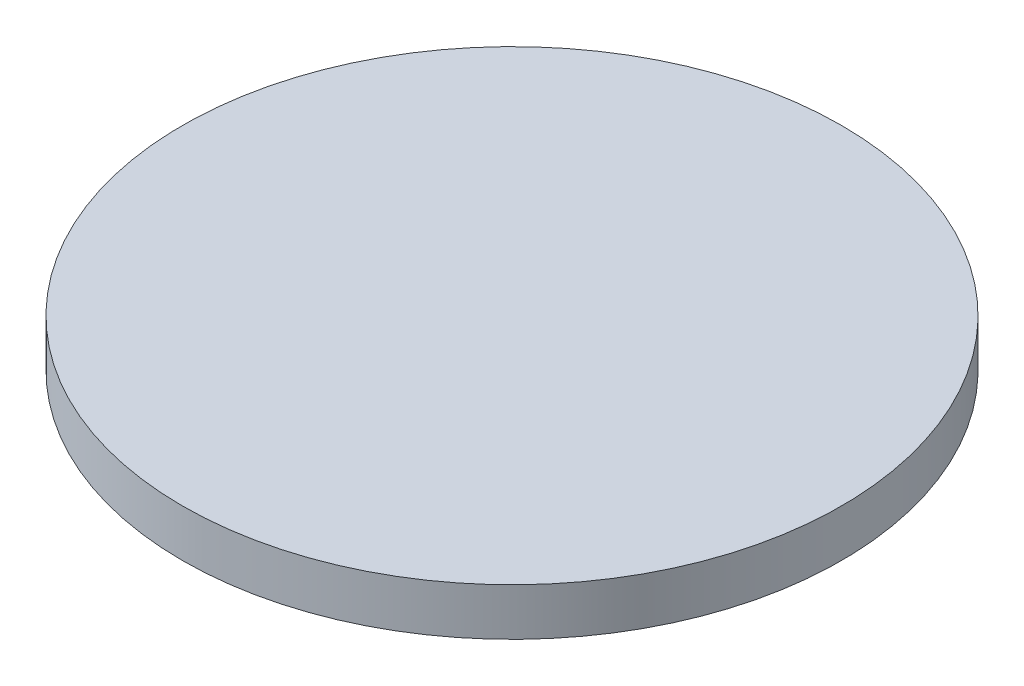
ISO-10303-21;
HEADER;
FILE_DESCRIPTION(('STEP AP214'),'2;1');
FILE_NAME('part.step','',(''),(''),'','','');
FILE_SCHEMA(('AUTOMOTIVE_DESIGN { 1 0 10303 214 1 1 1 1 }'));
ENDSEC;
DATA;
#1=APPLICATION_CONTEXT('core data for automotive mechanical design processes');
#2=APPLICATION_PROTOCOL_DEFINITION('international standard','automotive_design',2000,#1);
#3=PRODUCT_CONTEXT('',#1,'mechanical');
#4=PRODUCT('Part','Part','',(#3));
#5=PRODUCT_RELATED_PRODUCT_CATEGORY('part','',(#4));
#6=PRODUCT_DEFINITION_FORMATION('','',#4);
#7=PRODUCT_DEFINITION_CONTEXT('part definition',#1,'design');
#8=PRODUCT_DEFINITION('design','',#6,#7);
#9=PRODUCT_DEFINITION_SHAPE('','',#8);
#10=(LENGTH_UNIT() NAMED_UNIT(*) SI_UNIT(.MILLI.,.METRE.));
#11=(NAMED_UNIT(*) PLANE_ANGLE_UNIT() SI_UNIT($,.RADIAN.));
#12=(NAMED_UNIT(*) SI_UNIT($,.STERADIAN.) SOLID_ANGLE_UNIT());
#13=UNCERTAINTY_MEASURE_WITH_UNIT(LENGTH_MEASURE(1.E-05),#10,'distance_accuracy_value','');
#14=(GEOMETRIC_REPRESENTATION_CONTEXT(3) GLOBAL_UNCERTAINTY_ASSIGNED_CONTEXT((#13)) GLOBAL_UNIT_ASSIGNED_CONTEXT((#10,
#11,#12)) REPRESENTATION_CONTEXT('',''));
#15=CARTESIAN_POINT('',(0.,0.,0.));
#16=DIRECTION('',(0.,0.,1.));
#17=DIRECTION('',(1.,0.,0.));
#18=AXIS2_PLACEMENT_3D('',#15,#16,#17);
#19=CARTESIAN_POINT('',(0.,1.5,0.));
#20=DIRECTION('',(0.,-1.,0.));
#21=DIRECTION('',(0.,0.,-1.));
#22=AXIS2_PLACEMENT_3D('',#19,#20,#21);
#23=CYLINDRICAL_SURFACE('',#22,10.45);
#24=CARTESIAN_POINT('',(0.,1.5,0.));
#25=DIRECTION('',(0.,1.,0.));
#26=DIRECTION('',(0.,0.,1.));
#27=AXIS2_PLACEMENT_3D('',#24,#25,#26);
#28=CIRCLE('',#27,10.45);
#29=CARTESIAN_POINT('',(0.,1.5,10.45));
#30=VERTEX_POINT('',#29);
#31=EDGE_CURVE('E10',#30,#30,#28,.T.);
#32=ORIENTED_EDGE('',*,*,#31,.F.);
#33=EDGE_LOOP('',(#32));
#34=FACE_BOUND('',#33,.T.);
#35=CARTESIAN_POINT('',(0.,0.,0.));
#36=DIRECTION('',(0.,1.,0.));
#37=DIRECTION('',(0.,0.,1.));
#38=AXIS2_PLACEMENT_3D('',#35,#36,#37);
#39=CIRCLE('',#38,10.45);
#40=CARTESIAN_POINT('',(0.,0.,10.45));
#41=VERTEX_POINT('',#40);
#42=EDGE_CURVE('E40',#41,#41,#39,.T.);
#43=ORIENTED_EDGE('',*,*,#42,.T.);
#44=EDGE_LOOP('',(#43));
#45=FACE_BOUND('',#44,.T.);
#46=ADVANCED_FACE('F37',(#34,#45),#23,.T.);
#47=CARTESIAN_POINT('',(0.,1.5,0.));
#48=DIRECTION('',(0.,1.,0.));
#49=DIRECTION('',(0.,0.,1.));
#50=AXIS2_PLACEMENT_3D('',#47,#48,#49);
#51=PLANE('',#50);
#52=ORIENTED_EDGE('',*,*,#31,.T.);
#53=EDGE_LOOP('',(#52));
#54=FACE_BOUND('',#53,.T.);
#55=ADVANCED_FACE('F54',(#54),#51,.T.);
#56=CARTESIAN_POINT('',(0.,0.,0.));
#57=DIRECTION('',(0.,1.,0.));
#58=DIRECTION('',(0.,0.,1.));
#59=AXIS2_PLACEMENT_3D('',#56,#57,#58);
#60=PLANE('',#59);
#61=ORIENTED_EDGE('',*,*,#42,.F.);
#62=EDGE_LOOP('',(#61));
#63=FACE_BOUND('',#62,.T.);
#64=ADVANCED_FACE('F52',(#63),#60,.F.);
#65=CLOSED_SHELL('',(#46,#55,#64));
#66=MANIFOLD_SOLID_BREP('B2',#65);
#67=ADVANCED_BREP_SHAPE_REPRESENTATION('',(#18,#66),#14);
#68=SHAPE_DEFINITION_REPRESENTATION(#9,#67);
ENDSEC;
END-ISO-10303-21;
